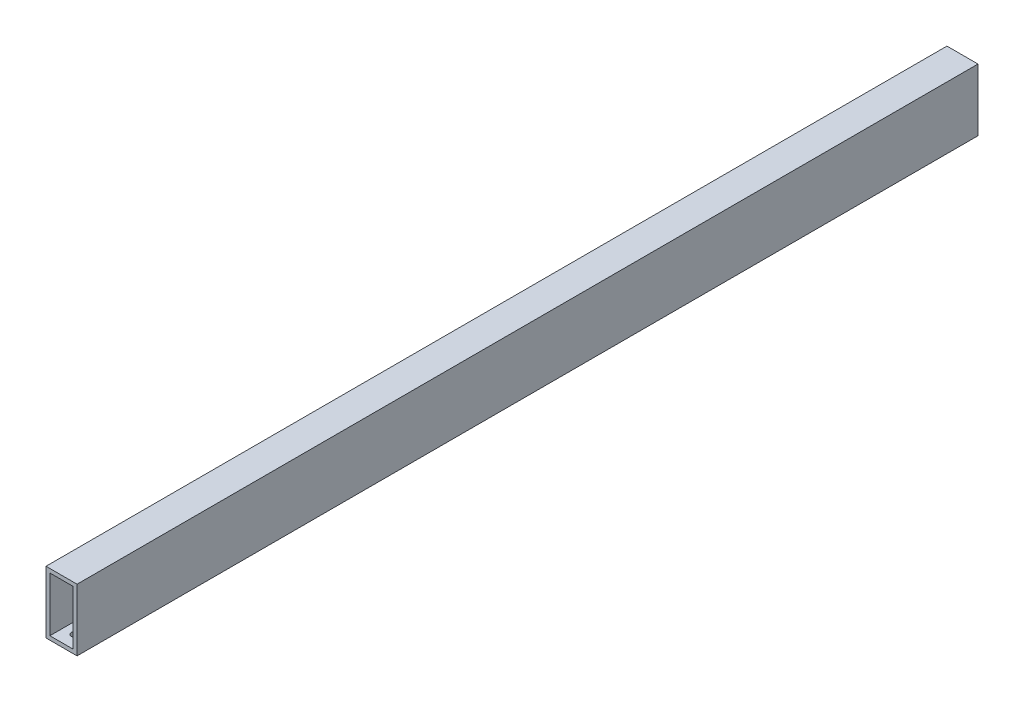
ISO-10303-21;
HEADER;
FILE_DESCRIPTION(('STEP AP214'),'2;1');
FILE_NAME('part.step','',(''),(''),'','','');
FILE_SCHEMA(('AUTOMOTIVE_DESIGN { 1 0 10303 214 1 1 1 1 }'));
ENDSEC;
DATA;
#1=APPLICATION_CONTEXT('core data for automotive mechanical design processes');
#2=APPLICATION_PROTOCOL_DEFINITION('international standard','automotive_design',2000,#1);
#3=PRODUCT_CONTEXT('',#1,'mechanical');
#4=PRODUCT('Part','Part','',(#3));
#5=PRODUCT_RELATED_PRODUCT_CATEGORY('part','',(#4));
#6=PRODUCT_DEFINITION_FORMATION('','',#4);
#7=PRODUCT_DEFINITION_CONTEXT('part definition',#1,'design');
#8=PRODUCT_DEFINITION('design','',#6,#7);
#9=PRODUCT_DEFINITION_SHAPE('','',#8);
#10=(LENGTH_UNIT() NAMED_UNIT(*) SI_UNIT(.MILLI.,.METRE.));
#11=(NAMED_UNIT(*) PLANE_ANGLE_UNIT() SI_UNIT($,.RADIAN.));
#12=(NAMED_UNIT(*) SI_UNIT($,.STERADIAN.) SOLID_ANGLE_UNIT());
#13=UNCERTAINTY_MEASURE_WITH_UNIT(LENGTH_MEASURE(1.E-05),#10,'distance_accuracy_value','');
#14=(GEOMETRIC_REPRESENTATION_CONTEXT(3) GLOBAL_UNCERTAINTY_ASSIGNED_CONTEXT((#13)) GLOBAL_UNIT_ASSIGNED_CONTEXT((#10,
#11,#12)) REPRESENTATION_CONTEXT('',''));
#15=CARTESIAN_POINT('',(0.,0.,0.));
#16=DIRECTION('',(0.,0.,1.));
#17=DIRECTION('',(1.,0.,0.));
#18=AXIS2_PLACEMENT_3D('',#15,#16,#17);
#19=CARTESIAN_POINT('',(0.,0.,736.6));
#20=DIRECTION('',(0.,1.,0.));
#21=DIRECTION('',(0.,0.,1.));
#22=AXIS2_PLACEMENT_3D('',#19,#20,#21);
#23=PLANE('',#22);
#24=CARTESIAN_POINT('',(12.6999999999997,0.,725.17));
#25=DIRECTION('',(0.,-1.,0.));
#26=DIRECTION('',(0.,0.,-1.));
#27=AXIS2_PLACEMENT_3D('',#24,#25,#26);
#28=CIRCLE('',#27,3.17500000000001);
#29=CARTESIAN_POINT('',(12.6999999999997,0.,721.995));
#30=VERTEX_POINT('',#29);
#31=EDGE_CURVE('E230',#30,#30,#28,.F.);
#32=ORIENTED_EDGE('',*,*,#31,.T.);
#33=EDGE_LOOP('',(#32));
#34=FACE_BOUND('',#33,.T.);
#35=CARTESIAN_POINT('',(12.6999999999997,0.,26.0582354721581));
#36=DIRECTION('',(0.,-1.,0.));
#37=DIRECTION('',(0.,0.,-1.));
#38=AXIS2_PLACEMENT_3D('',#35,#36,#37);
#39=CIRCLE('',#38,3.175);
#40=CARTESIAN_POINT('',(12.6999999999997,0.,22.8832354721581));
#41=VERTEX_POINT('',#40);
#42=EDGE_CURVE('E233',#41,#41,#39,.T.);
#43=ORIENTED_EDGE('',*,*,#42,.F.);
#44=EDGE_LOOP('',(#43));
#45=FACE_BOUND('',#44,.T.);
#46=CARTESIAN_POINT('',(12.6999999999997,0.,710.541764527842));
#47=DIRECTION('',(0.,-1.,0.));
#48=DIRECTION('',(0.,0.,-1.));
#49=AXIS2_PLACEMENT_3D('',#46,#47,#48);
#50=CIRCLE('',#49,3.175);
#51=CARTESIAN_POINT('',(12.6999999999997,0.,707.366764527841));
#52=VERTEX_POINT('',#51);
#53=EDGE_CURVE('E239',#52,#52,#50,.F.);
#54=ORIENTED_EDGE('',*,*,#53,.T.);
#55=EDGE_LOOP('',(#54));
#56=FACE_BOUND('',#55,.T.);
#57=DIRECTION('',(1.,0.,0.));
#58=VECTOR('',#57,1.);
#59=CARTESIAN_POINT('',(0.,0.,0.));
#60=LINE('',#59,#58);
#61=CARTESIAN_POINT('',(0.,0.,0.));
#62=VERTEX_POINT('',#61);
#63=CARTESIAN_POINT('',(25.4,0.,0.));
#64=VERTEX_POINT('',#63);
#65=EDGE_CURVE('E180',#62,#64,#60,.T.);
#66=ORIENTED_EDGE('',*,*,#65,.T.);
#67=DIRECTION('',(0.,0.,-1.));
#68=VECTOR('',#67,1.);
#69=CARTESIAN_POINT('',(25.4,0.,736.6));
#70=LINE('',#69,#68);
#71=CARTESIAN_POINT('',(25.4,0.,736.6));
#72=VERTEX_POINT('',#71);
#73=EDGE_CURVE('E53',#72,#64,#70,.T.);
#74=ORIENTED_EDGE('',*,*,#73,.F.);
#75=DIRECTION('',(1.,0.,0.));
#76=VECTOR('',#75,1.);
#77=CARTESIAN_POINT('',(0.,0.,736.6));
#78=LINE('',#77,#76);
#79=CARTESIAN_POINT('',(0.,0.,736.6));
#80=VERTEX_POINT('',#79);
#81=EDGE_CURVE('E166',#80,#72,#78,.T.);
#82=ORIENTED_EDGE('',*,*,#81,.F.);
#83=DIRECTION('',(0.,0.,-1.));
#84=VECTOR('',#83,1.);
#85=CARTESIAN_POINT('',(0.,0.,736.6));
#86=LINE('',#85,#84);
#87=EDGE_CURVE('E11',#80,#62,#86,.T.);
#88=ORIENTED_EDGE('',*,*,#87,.T.);
#89=EDGE_LOOP('',(#66,#74,#82,#88));
#90=FACE_BOUND('',#89,.T.);
#91=CARTESIAN_POINT('',(12.7000000000002,0.,11.4300000000001));
#92=DIRECTION('',(0.,-1.,0.));
#93=DIRECTION('',(0.,0.,-1.));
#94=AXIS2_PLACEMENT_3D('',#91,#92,#93);
#95=CIRCLE('',#94,3.17500000000001);
#96=CARTESIAN_POINT('',(12.7000000000002,0.,8.25500000000004));
#97=VERTEX_POINT('',#96);
#98=EDGE_CURVE('E222',#97,#97,#95,.T.);
#99=ORIENTED_EDGE('',*,*,#98,.F.);
#100=EDGE_LOOP('',(#99));
#101=FACE_BOUND('',#100,.T.);
#102=ADVANCED_FACE('F44',(#34,#45,#56,#90,#101),#23,.F.);
#103=CARTESIAN_POINT('',(3.175,3.175,736.6));
#104=DIRECTION('',(0.,1.,0.));
#105=DIRECTION('',(0.,0.,1.));
#106=AXIS2_PLACEMENT_3D('',#103,#104,#105);
#107=PLANE('',#106);
#108=CARTESIAN_POINT('',(12.6999999999997,3.175,725.17));
#109=DIRECTION('',(0.,1.,0.));
#110=DIRECTION('',(0.,0.,1.));
#111=AXIS2_PLACEMENT_3D('',#108,#109,#110);
#112=CIRCLE('',#111,3.17500000000001);
#113=CARTESIAN_POINT('',(12.6999999999997,3.175,728.345));
#114=VERTEX_POINT('',#113);
#115=EDGE_CURVE('E236',#114,#114,#112,.T.);
#116=ORIENTED_EDGE('',*,*,#115,.F.);
#117=EDGE_LOOP('',(#116));
#118=FACE_BOUND('',#117,.T.);
#119=CARTESIAN_POINT('',(12.6999999999997,3.175,710.541764527842));
#120=DIRECTION('',(0.,1.,0.));
#121=DIRECTION('',(0.,0.,1.));
#122=AXIS2_PLACEMENT_3D('',#119,#120,#121);
#123=CIRCLE('',#122,3.175);
#124=CARTESIAN_POINT('',(12.6999999999997,3.175,713.716764527842));
#125=VERTEX_POINT('',#124);
#126=EDGE_CURVE('E147',#125,#125,#123,.T.);
#127=ORIENTED_EDGE('',*,*,#126,.F.);
#128=EDGE_LOOP('',(#127));
#129=FACE_BOUND('',#128,.T.);
#130=DIRECTION('',(1.,0.,0.));
#131=VECTOR('',#130,1.);
#132=CARTESIAN_POINT('',(3.175,3.175,0.));
#133=LINE('',#132,#131);
#134=CARTESIAN_POINT('',(3.175,3.175,0.));
#135=VERTEX_POINT('',#134);
#136=CARTESIAN_POINT('',(22.225,3.175,0.));
#137=VERTEX_POINT('',#136);
#138=EDGE_CURVE('E68',#135,#137,#133,.T.);
#139=ORIENTED_EDGE('',*,*,#138,.F.);
#140=DIRECTION('',(0.,0.,-1.));
#141=VECTOR('',#140,1.);
#142=CARTESIAN_POINT('',(3.175,3.175,736.6));
#143=LINE('',#142,#141);
#144=CARTESIAN_POINT('',(3.175,3.175,736.6));
#145=VERTEX_POINT('',#144);
#146=EDGE_CURVE('E115',#145,#135,#143,.T.);
#147=ORIENTED_EDGE('',*,*,#146,.F.);
#148=DIRECTION('',(1.,0.,0.));
#149=VECTOR('',#148,1.);
#150=CARTESIAN_POINT('',(3.175,3.175,736.6));
#151=LINE('',#150,#149);
#152=CARTESIAN_POINT('',(22.225,3.175,736.6));
#153=VERTEX_POINT('',#152);
#154=EDGE_CURVE('E110',#145,#153,#151,.T.);
#155=ORIENTED_EDGE('',*,*,#154,.T.);
#156=DIRECTION('',(0.,0.,-1.));
#157=VECTOR('',#156,1.);
#158=CARTESIAN_POINT('',(22.225,3.175,736.6));
#159=LINE('',#158,#157);
#160=EDGE_CURVE('E114',#153,#137,#159,.T.);
#161=ORIENTED_EDGE('',*,*,#160,.T.);
#162=EDGE_LOOP('',(#139,#147,#155,#161));
#163=FACE_BOUND('',#162,.T.);
#164=CARTESIAN_POINT('',(12.6999999999997,3.175,26.0582354721581));
#165=DIRECTION('',(0.,1.,0.));
#166=DIRECTION('',(0.,0.,1.));
#167=AXIS2_PLACEMENT_3D('',#164,#165,#166);
#168=CIRCLE('',#167,3.175);
#169=CARTESIAN_POINT('',(12.6999999999997,3.175,29.2332354721581));
#170=VERTEX_POINT('',#169);
#171=EDGE_CURVE('E226',#170,#170,#168,.F.);
#172=ORIENTED_EDGE('',*,*,#171,.T.);
#173=EDGE_LOOP('',(#172));
#174=FACE_BOUND('',#173,.T.);
#175=CARTESIAN_POINT('',(12.7000000000002,3.175,11.4300000000001));
#176=DIRECTION('',(0.,1.,0.));
#177=DIRECTION('',(0.,0.,1.));
#178=AXIS2_PLACEMENT_3D('',#175,#176,#177);
#179=CIRCLE('',#178,3.17500000000001);
#180=CARTESIAN_POINT('',(12.7000000000002,3.175,14.6050000000001));
#181=VERTEX_POINT('',#180);
#182=EDGE_CURVE('E225',#181,#181,#179,.F.);
#183=ORIENTED_EDGE('',*,*,#182,.T.);
#184=EDGE_LOOP('',(#183));
#185=FACE_BOUND('',#184,.T.);
#186=ADVANCED_FACE('F112',(#118,#129,#163,#174,#185),#107,.T.);
#187=CARTESIAN_POINT('',(0.,0.,736.6));
#188=DIRECTION('',(0.,0.,-1.));
#189=DIRECTION('',(-1.,0.,0.));
#190=AXIS2_PLACEMENT_3D('',#187,#188,#189);
#191=PLANE('',#190);
#192=DIRECTION('',(0.,-1.,0.));
#193=VECTOR('',#192,1.);
#194=CARTESIAN_POINT('',(0.,0.,736.6));
#195=LINE('',#194,#193);
#196=CARTESIAN_POINT('',(0.,50.8,736.6));
#197=VERTEX_POINT('',#196);
#198=EDGE_CURVE('E162',#197,#80,#195,.T.);
#199=ORIENTED_EDGE('',*,*,#198,.T.);
#200=ORIENTED_EDGE('',*,*,#81,.T.);
#201=DIRECTION('',(0.,1.,0.));
#202=VECTOR('',#201,1.);
#203=CARTESIAN_POINT('',(25.4,0.,736.6));
#204=LINE('',#203,#202);
#205=CARTESIAN_POINT('',(25.4,50.8,736.6));
#206=VERTEX_POINT('',#205);
#207=EDGE_CURVE('E170',#72,#206,#204,.T.);
#208=ORIENTED_EDGE('',*,*,#207,.T.);
#209=DIRECTION('',(-1.,0.,0.));
#210=VECTOR('',#209,1.);
#211=CARTESIAN_POINT('',(0.,50.8,736.6));
#212=LINE('',#211,#210);
#213=EDGE_CURVE('E173',#206,#197,#212,.T.);
#214=ORIENTED_EDGE('',*,*,#213,.T.);
#215=EDGE_LOOP('',(#199,#200,#208,#214));
#216=FACE_BOUND('',#215,.T.);
#217=ORIENTED_EDGE('',*,*,#154,.F.);
#218=DIRECTION('',(0.,-1.,0.));
#219=VECTOR('',#218,1.);
#220=CARTESIAN_POINT('',(3.175,3.175,736.6));
#221=LINE('',#220,#219);
#222=CARTESIAN_POINT('',(3.175,47.625,736.6));
#223=VERTEX_POINT('',#222);
#224=EDGE_CURVE('E140',#223,#145,#221,.T.);
#225=ORIENTED_EDGE('',*,*,#224,.F.);
#226=DIRECTION('',(-1.,0.,0.));
#227=VECTOR('',#226,1.);
#228=CARTESIAN_POINT('',(3.175,47.625,736.6));
#229=LINE('',#228,#227);
#230=CARTESIAN_POINT('',(22.225,47.625,736.6));
#231=VERTEX_POINT('',#230);
#232=EDGE_CURVE('E134',#231,#223,#229,.T.);
#233=ORIENTED_EDGE('',*,*,#232,.F.);
#234=DIRECTION('',(0.,1.,0.));
#235=VECTOR('',#234,1.);
#236=CARTESIAN_POINT('',(22.225,3.175,736.6));
#237=LINE('',#236,#235);
#238=EDGE_CURVE('E120',#153,#231,#237,.T.);
#239=ORIENTED_EDGE('',*,*,#238,.F.);
#240=EDGE_LOOP('',(#217,#225,#233,#239));
#241=FACE_BOUND('',#240,.T.);
#242=ADVANCED_FACE('F133',(#216,#241),#191,.F.);
#243=CARTESIAN_POINT('',(0.,0.,0.));
#244=DIRECTION('',(0.,0.,-1.));
#245=DIRECTION('',(-1.,0.,0.));
#246=AXIS2_PLACEMENT_3D('',#243,#244,#245);
#247=PLANE('',#246);
#248=DIRECTION('',(0.,-1.,0.));
#249=VECTOR('',#248,1.);
#250=CARTESIAN_POINT('',(0.,0.,0.));
#251=LINE('',#250,#249);
#252=CARTESIAN_POINT('',(0.,50.8,0.));
#253=VERTEX_POINT('',#252);
#254=EDGE_CURVE('E129',#253,#62,#251,.T.);
#255=ORIENTED_EDGE('',*,*,#254,.F.);
#256=DIRECTION('',(-1.,0.,0.));
#257=VECTOR('',#256,1.);
#258=CARTESIAN_POINT('',(0.,50.8,0.));
#259=LINE('',#258,#257);
#260=CARTESIAN_POINT('',(25.4,50.8,0.));
#261=VERTEX_POINT('',#260);
#262=EDGE_CURVE('E167',#261,#253,#259,.T.);
#263=ORIENTED_EDGE('',*,*,#262,.F.);
#264=DIRECTION('',(0.,1.,0.));
#265=VECTOR('',#264,1.);
#266=CARTESIAN_POINT('',(25.4,0.,0.));
#267=LINE('',#266,#265);
#268=EDGE_CURVE('E183',#64,#261,#267,.T.);
#269=ORIENTED_EDGE('',*,*,#268,.F.);
#270=ORIENTED_EDGE('',*,*,#65,.F.);
#271=EDGE_LOOP('',(#255,#263,#269,#270));
#272=FACE_BOUND('',#271,.T.);
#273=DIRECTION('',(0.,-1.,0.));
#274=VECTOR('',#273,1.);
#275=CARTESIAN_POINT('',(3.175,3.175,0.));
#276=LINE('',#275,#274);
#277=CARTESIAN_POINT('',(3.175,47.625,0.));
#278=VERTEX_POINT('',#277);
#279=EDGE_CURVE('E121',#278,#135,#276,.T.);
#280=ORIENTED_EDGE('',*,*,#279,.T.);
#281=ORIENTED_EDGE('',*,*,#138,.T.);
#282=DIRECTION('',(0.,1.,0.));
#283=VECTOR('',#282,1.);
#284=CARTESIAN_POINT('',(22.225,3.175,0.));
#285=LINE('',#284,#283);
#286=CARTESIAN_POINT('',(22.225,47.625,0.));
#287=VERTEX_POINT('',#286);
#288=EDGE_CURVE('E127',#137,#287,#285,.T.);
#289=ORIENTED_EDGE('',*,*,#288,.T.);
#290=DIRECTION('',(-1.,0.,0.));
#291=VECTOR('',#290,1.);
#292=CARTESIAN_POINT('',(3.175,47.625,0.));
#293=LINE('',#292,#291);
#294=EDGE_CURVE('E150',#287,#278,#293,.T.);
#295=ORIENTED_EDGE('',*,*,#294,.T.);
#296=EDGE_LOOP('',(#280,#281,#289,#295));
#297=FACE_BOUND('',#296,.T.);
#298=ADVANCED_FACE('F207',(#272,#297),#247,.T.);
#299=CARTESIAN_POINT('',(0.,0.,736.6));
#300=DIRECTION('',(1.,0.,0.));
#301=DIRECTION('',(0.,0.,-1.));
#302=AXIS2_PLACEMENT_3D('',#299,#300,#301);
#303=PLANE('',#302);
#304=ORIENTED_EDGE('',*,*,#254,.T.);
#305=ORIENTED_EDGE('',*,*,#87,.F.);
#306=ORIENTED_EDGE('',*,*,#198,.F.);
#307=DIRECTION('',(0.,0.,-1.));
#308=VECTOR('',#307,1.);
#309=CARTESIAN_POINT('',(0.,50.8,736.6));
#310=LINE('',#309,#308);
#311=EDGE_CURVE('E176',#197,#253,#310,.T.);
#312=ORIENTED_EDGE('',*,*,#311,.T.);
#313=EDGE_LOOP('',(#304,#305,#306,#312));
#314=FACE_BOUND('',#313,.T.);
#315=ADVANCED_FACE('F46',(#314),#303,.F.);
#316=CARTESIAN_POINT('',(25.4,0.,736.6));
#317=DIRECTION('',(-1.,0.,0.));
#318=DIRECTION('',(0.,0.,1.));
#319=AXIS2_PLACEMENT_3D('',#316,#317,#318);
#320=PLANE('',#319);
#321=ORIENTED_EDGE('',*,*,#268,.T.);
#322=DIRECTION('',(0.,0.,-1.));
#323=VECTOR('',#322,1.);
#324=CARTESIAN_POINT('',(25.4,50.8,736.6));
#325=LINE('',#324,#323);
#326=EDGE_CURVE('E191',#206,#261,#325,.T.);
#327=ORIENTED_EDGE('',*,*,#326,.F.);
#328=ORIENTED_EDGE('',*,*,#207,.F.);
#329=ORIENTED_EDGE('',*,*,#73,.T.);
#330=EDGE_LOOP('',(#321,#327,#328,#329));
#331=FACE_BOUND('',#330,.T.);
#332=ADVANCED_FACE('F201',(#331),#320,.F.);
#333=CARTESIAN_POINT('',(0.,50.8,736.6));
#334=DIRECTION('',(0.,-1.,0.));
#335=DIRECTION('',(0.,0.,-1.));
#336=AXIS2_PLACEMENT_3D('',#333,#334,#335);
#337=PLANE('',#336);
#338=ORIENTED_EDGE('',*,*,#262,.T.);
#339=ORIENTED_EDGE('',*,*,#311,.F.);
#340=ORIENTED_EDGE('',*,*,#213,.F.);
#341=ORIENTED_EDGE('',*,*,#326,.T.);
#342=EDGE_LOOP('',(#338,#339,#340,#341));
#343=FACE_BOUND('',#342,.T.);
#344=ADVANCED_FACE('F211',(#343),#337,.F.);
#345=CARTESIAN_POINT('',(22.225,3.175,736.6));
#346=DIRECTION('',(-1.,0.,0.));
#347=DIRECTION('',(0.,0.,1.));
#348=AXIS2_PLACEMENT_3D('',#345,#346,#347);
#349=PLANE('',#348);
#350=ORIENTED_EDGE('',*,*,#288,.F.);
#351=ORIENTED_EDGE('',*,*,#160,.F.);
#352=ORIENTED_EDGE('',*,*,#238,.T.);
#353=DIRECTION('',(0.,0.,-1.));
#354=VECTOR('',#353,1.);
#355=CARTESIAN_POINT('',(22.225,47.625,736.6));
#356=LINE('',#355,#354);
#357=EDGE_CURVE('E130',#231,#287,#356,.T.);
#358=ORIENTED_EDGE('',*,*,#357,.T.);
#359=EDGE_LOOP('',(#350,#351,#352,#358));
#360=FACE_BOUND('',#359,.T.);
#361=ADVANCED_FACE('F124',(#360),#349,.T.);
#362=CARTESIAN_POINT('',(3.175,47.625,736.6));
#363=DIRECTION('',(0.,-1.,0.));
#364=DIRECTION('',(0.,0.,-1.));
#365=AXIS2_PLACEMENT_3D('',#362,#363,#364);
#366=PLANE('',#365);
#367=ORIENTED_EDGE('',*,*,#294,.F.);
#368=ORIENTED_EDGE('',*,*,#357,.F.);
#369=ORIENTED_EDGE('',*,*,#232,.T.);
#370=DIRECTION('',(0.,0.,-1.));
#371=VECTOR('',#370,1.);
#372=CARTESIAN_POINT('',(3.175,47.625,736.6));
#373=LINE('',#372,#371);
#374=EDGE_CURVE('E60',#223,#278,#373,.T.);
#375=ORIENTED_EDGE('',*,*,#374,.T.);
#376=EDGE_LOOP('',(#367,#368,#369,#375));
#377=FACE_BOUND('',#376,.T.);
#378=ADVANCED_FACE('F298',(#377),#366,.T.);
#379=CARTESIAN_POINT('',(3.175,3.175,736.6));
#380=DIRECTION('',(1.,0.,0.));
#381=DIRECTION('',(0.,0.,-1.));
#382=AXIS2_PLACEMENT_3D('',#379,#380,#381);
#383=PLANE('',#382);
#384=ORIENTED_EDGE('',*,*,#279,.F.);
#385=ORIENTED_EDGE('',*,*,#374,.F.);
#386=ORIENTED_EDGE('',*,*,#224,.T.);
#387=ORIENTED_EDGE('',*,*,#146,.T.);
#388=EDGE_LOOP('',(#384,#385,#386,#387));
#389=FACE_BOUND('',#388,.T.);
#390=ADVANCED_FACE('F292',(#389),#383,.T.);
#391=CARTESIAN_POINT('',(12.6999999999997,12.1552561210692,710.541764527842));
#392=DIRECTION('',(0.,-1.,0.));
#393=DIRECTION('',(0.,0.,-1.));
#394=AXIS2_PLACEMENT_3D('',#391,#392,#393);
#395=CYLINDRICAL_SURFACE('',#394,3.175);
#396=ORIENTED_EDGE('',*,*,#53,.F.);
#397=EDGE_LOOP('',(#396));
#398=FACE_BOUND('',#397,.T.);
#399=ORIENTED_EDGE('',*,*,#126,.T.);
#400=EDGE_LOOP('',(#399));
#401=FACE_BOUND('',#400,.T.);
#402=ADVANCED_FACE('F247',(#398,#401),#395,.F.);
#403=CARTESIAN_POINT('',(12.6999999999997,12.1552561210692,26.0582354721581));
#404=DIRECTION('',(0.,-1.,0.));
#405=DIRECTION('',(0.,0.,-1.));
#406=AXIS2_PLACEMENT_3D('',#403,#404,#405);
#407=CYLINDRICAL_SURFACE('',#406,3.175);
#408=ORIENTED_EDGE('',*,*,#42,.T.);
#409=EDGE_LOOP('',(#408));
#410=FACE_BOUND('',#409,.T.);
#411=ORIENTED_EDGE('',*,*,#171,.F.);
#412=EDGE_LOOP('',(#411));
#413=FACE_BOUND('',#412,.T.);
#414=ADVANCED_FACE('F345',(#410,#413),#407,.F.);
#415=CARTESIAN_POINT('',(12.7000000000002,12.1552561210692,11.4300000000001));
#416=DIRECTION('',(0.,-1.,0.));
#417=DIRECTION('',(0.,0.,-1.));
#418=AXIS2_PLACEMENT_3D('',#415,#416,#417);
#419=CYLINDRICAL_SURFACE('',#418,3.17500000000001);
#420=ORIENTED_EDGE('',*,*,#98,.T.);
#421=EDGE_LOOP('',(#420));
#422=FACE_BOUND('',#421,.T.);
#423=ORIENTED_EDGE('',*,*,#182,.F.);
#424=EDGE_LOOP('',(#423));
#425=FACE_BOUND('',#424,.T.);
#426=ADVANCED_FACE('F351',(#422,#425),#419,.F.);
#427=CARTESIAN_POINT('',(12.6999999999997,12.1552561210692,725.17));
#428=DIRECTION('',(0.,-1.,0.));
#429=DIRECTION('',(0.,0.,-1.));
#430=AXIS2_PLACEMENT_3D('',#427,#428,#429);
#431=CYLINDRICAL_SURFACE('',#430,3.17500000000001);
#432=ORIENTED_EDGE('',*,*,#31,.F.);
#433=EDGE_LOOP('',(#432));
#434=FACE_BOUND('',#433,.T.);
#435=ORIENTED_EDGE('',*,*,#115,.T.);
#436=EDGE_LOOP('',(#435));
#437=FACE_BOUND('',#436,.T.);
#438=ADVANCED_FACE('F358',(#434,#437),#431,.F.);
#439=CLOSED_SHELL('',(#102,#186,#242,#298,#315,#332,#344,#361,#378,#390,#402,#414,#426,#438));
#440=MANIFOLD_SOLID_BREP('B2',#439);
#441=ADVANCED_BREP_SHAPE_REPRESENTATION('',(#18,#440),#14);
#442=SHAPE_DEFINITION_REPRESENTATION(#9,#441);
ENDSEC;
END-ISO-10303-21;
